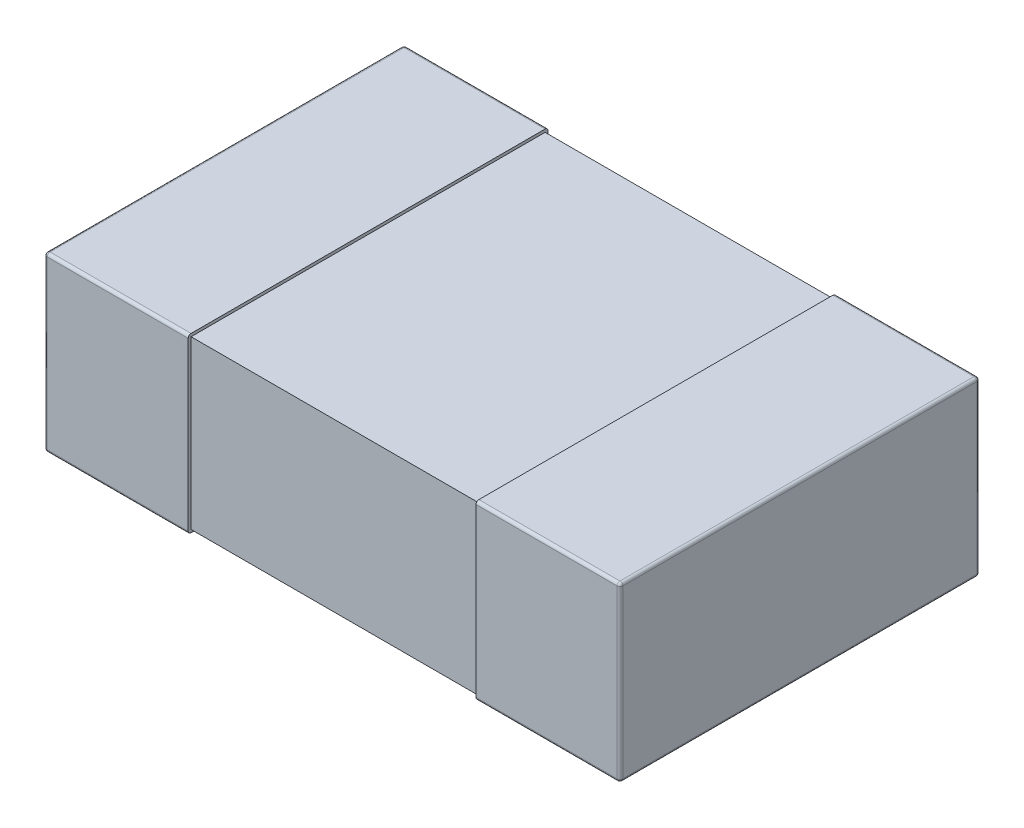
ISO-10303-21;
HEADER;
FILE_DESCRIPTION(('STEP AP214'),'2;1');
FILE_NAME('part.step','',(''),(''),'','','');
FILE_SCHEMA(('AUTOMOTIVE_DESIGN { 1 0 10303 214 1 1 1 1 }'));
ENDSEC;
DATA;
#1=APPLICATION_CONTEXT('core data for automotive mechanical design processes');
#2=APPLICATION_PROTOCOL_DEFINITION('international standard','automotive_design',2000,#1);
#3=PRODUCT_CONTEXT('',#1,'mechanical');
#4=PRODUCT('Part','Part','',(#3));
#5=PRODUCT_RELATED_PRODUCT_CATEGORY('part','',(#4));
#6=PRODUCT_DEFINITION_FORMATION('','',#4);
#7=PRODUCT_DEFINITION_CONTEXT('part definition',#1,'design');
#8=PRODUCT_DEFINITION('design','',#6,#7);
#9=PRODUCT_DEFINITION_SHAPE('','',#8);
#10=(LENGTH_UNIT() NAMED_UNIT(*) SI_UNIT(.MILLI.,.METRE.));
#11=(NAMED_UNIT(*) PLANE_ANGLE_UNIT() SI_UNIT($,.RADIAN.));
#12=(NAMED_UNIT(*) SI_UNIT($,.STERADIAN.) SOLID_ANGLE_UNIT());
#13=UNCERTAINTY_MEASURE_WITH_UNIT(LENGTH_MEASURE(1.E-05),#10,'distance_accuracy_value','');
#14=(GEOMETRIC_REPRESENTATION_CONTEXT(3) GLOBAL_UNCERTAINTY_ASSIGNED_CONTEXT((#13)) GLOBAL_UNIT_ASSIGNED_CONTEXT((#10,
#11,#12)) REPRESENTATION_CONTEXT('',''));
#15=CARTESIAN_POINT('',(0.,0.,0.));
#16=DIRECTION('',(0.,0.,1.));
#17=DIRECTION('',(1.,0.,0.));
#18=AXIS2_PLACEMENT_3D('',#15,#16,#17);
#19=CARTESIAN_POINT('',(-1.,0.3,-0.625));
#20=DIRECTION('',(1.,0.,0.));
#21=DIRECTION('',(0.,0.,-1.));
#22=AXIS2_PLACEMENT_3D('',#19,#20,#21);
#23=PLANE('',#22);
#24=DIRECTION('',(0.,0.,1.));
#25=VECTOR('',#24,1.);
#26=CARTESIAN_POINT('',(-1.,-0.29,-0.625));
#27=LINE('',#26,#25);
#28=CARTESIAN_POINT('',(-1.,-0.29,0.615));
#29=VERTEX_POINT('',#28);
#30=CARTESIAN_POINT('',(-1.,-0.29,-0.615));
#31=VERTEX_POINT('',#30);
#32=EDGE_CURVE('E414',#29,#31,#27,.F.);
#33=ORIENTED_EDGE('',*,*,#32,.F.);
#34=DIRECTION('',(0.,-1.,0.));
#35=VECTOR('',#34,1.);
#36=CARTESIAN_POINT('',(-1.,0.3,0.615));
#37=LINE('',#36,#35);
#38=CARTESIAN_POINT('',(-1.,0.29,0.615));
#39=VERTEX_POINT('',#38);
#40=EDGE_CURVE('E516',#39,#29,#37,.T.);
#41=ORIENTED_EDGE('',*,*,#40,.F.);
#42=DIRECTION('',(0.,0.,-1.));
#43=VECTOR('',#42,1.);
#44=CARTESIAN_POINT('',(-1.,0.29,0.625));
#45=LINE('',#44,#43);
#46=CARTESIAN_POINT('',(-1.,0.29,-0.615));
#47=VERTEX_POINT('',#46);
#48=EDGE_CURVE('E447',#47,#39,#45,.F.);
#49=ORIENTED_EDGE('',*,*,#48,.F.);
#50=DIRECTION('',(0.,-1.,0.));
#51=VECTOR('',#50,1.);
#52=CARTESIAN_POINT('',(-1.,0.3,-0.615));
#53=LINE('',#52,#51);
#54=EDGE_CURVE('E507',#31,#47,#53,.F.);
#55=ORIENTED_EDGE('',*,*,#54,.F.);
#56=EDGE_LOOP('',(#33,#41,#49,#55));
#57=FACE_BOUND('',#56,.T.);
#58=ADVANCED_FACE('F17',(#57),#23,.F.);
#59=CARTESIAN_POINT('',(1.,0.3,-0.625));
#60=DIRECTION('',(-1.,0.,0.));
#61=DIRECTION('',(0.,0.,1.));
#62=AXIS2_PLACEMENT_3D('',#59,#60,#61);
#63=PLANE('',#62);
#64=DIRECTION('',(0.,0.,-1.));
#65=VECTOR('',#64,1.);
#66=CARTESIAN_POINT('',(1.,0.29,0.625));
#67=LINE('',#66,#65);
#68=CARTESIAN_POINT('',(1.,0.29,0.615));
#69=VERTEX_POINT('',#68);
#70=CARTESIAN_POINT('',(1.,0.29,-0.615));
#71=VERTEX_POINT('',#70);
#72=EDGE_CURVE('E364',#69,#71,#67,.T.);
#73=ORIENTED_EDGE('',*,*,#72,.F.);
#74=DIRECTION('',(0.,-1.,0.));
#75=VECTOR('',#74,1.);
#76=CARTESIAN_POINT('',(1.,0.3,0.615));
#77=LINE('',#76,#75);
#78=CARTESIAN_POINT('',(1.,-0.29,0.615));
#79=VERTEX_POINT('',#78);
#80=EDGE_CURVE('E488',#79,#69,#77,.F.);
#81=ORIENTED_EDGE('',*,*,#80,.F.);
#82=DIRECTION('',(0.,0.,1.));
#83=VECTOR('',#82,1.);
#84=CARTESIAN_POINT('',(1.,-0.29,-0.625));
#85=LINE('',#84,#83);
#86=CARTESIAN_POINT('',(1.,-0.29,-0.615));
#87=VERTEX_POINT('',#86);
#88=EDGE_CURVE('E304',#87,#79,#85,.T.);
#89=ORIENTED_EDGE('',*,*,#88,.F.);
#90=DIRECTION('',(0.,-1.,0.));
#91=VECTOR('',#90,1.);
#92=CARTESIAN_POINT('',(1.,0.3,-0.615));
#93=LINE('',#92,#91);
#94=EDGE_CURVE('E497',#71,#87,#93,.T.);
#95=ORIENTED_EDGE('',*,*,#94,.F.);
#96=EDGE_LOOP('',(#73,#81,#89,#95));
#97=FACE_BOUND('',#96,.T.);
#98=ADVANCED_FACE('F477',(#97),#63,.F.);
#99=CARTESIAN_POINT('',(-0.99,-0.29,0.615));
#100=DIRECTION('',(1.,0.,0.));
#101=DIRECTION('',(0.,-1.,0.));
#102=AXIS2_PLACEMENT_3D('',#99,#100,#101);
#103=SPHERICAL_SURFACE('',#102,0.01);
#104=CARTESIAN_POINT('',(-0.99,-0.29,0.615));
#105=DIRECTION('',(0.,-1.,0.));
#106=DIRECTION('',(0.,0.,-1.));
#107=AXIS2_PLACEMENT_3D('',#104,#105,#106);
#108=CIRCLE('',#107,0.01);
#109=CARTESIAN_POINT('',(-0.99,-0.29,0.625));
#110=VERTEX_POINT('',#109);
#111=EDGE_CURVE('E519',#29,#110,#108,.F.);
#112=ORIENTED_EDGE('',*,*,#111,.F.);
#113=CARTESIAN_POINT('',(-0.99,-0.29,0.615));
#114=DIRECTION('',(0.,0.,1.));
#115=DIRECTION('',(1.,0.,0.));
#116=AXIS2_PLACEMENT_3D('',#113,#114,#115);
#117=CIRCLE('',#116,0.01);
#118=CARTESIAN_POINT('',(-0.99,-0.3,0.615));
#119=VERTEX_POINT('',#118);
#120=EDGE_CURVE('E401',#119,#29,#117,.F.);
#121=ORIENTED_EDGE('',*,*,#120,.F.);
#122=CARTESIAN_POINT('',(-0.99,-0.29,0.615));
#123=DIRECTION('',(1.,0.,0.));
#124=DIRECTION('',(0.,0.,-1.));
#125=AXIS2_PLACEMENT_3D('',#122,#123,#124);
#126=CIRCLE('',#125,0.01);
#127=EDGE_CURVE('E196',#110,#119,#126,.T.);
#128=ORIENTED_EDGE('',*,*,#127,.F.);
#129=EDGE_LOOP('',(#112,#121,#128));
#130=FACE_BOUND('',#129,.T.);
#131=ADVANCED_FACE('F473',(#130),#103,.T.);
#132=CARTESIAN_POINT('',(-0.99,0.3,0.615));
#133=DIRECTION('',(0.,-1.,0.));
#134=DIRECTION('',(0.,0.,-1.));
#135=AXIS2_PLACEMENT_3D('',#132,#133,#134);
#136=CYLINDRICAL_SURFACE('',#135,0.01);
#137=ORIENTED_EDGE('',*,*,#111,.T.);
#138=DIRECTION('',(0.,1.,0.));
#139=VECTOR('',#138,1.);
#140=CARTESIAN_POINT('',(-0.99,0.3,0.625));
#141=LINE('',#140,#139);
#142=CARTESIAN_POINT('',(-0.99,0.289999999999998,0.625));
#143=VERTEX_POINT('',#142);
#144=EDGE_CURVE('E195',#110,#143,#141,.T.);
#145=ORIENTED_EDGE('',*,*,#144,.T.);
#146=CARTESIAN_POINT('',(-0.99,0.29,0.615));
#147=DIRECTION('',(0.,-1.,-6.71279188273423E-13));
#148=DIRECTION('',(1.,0.,0.));
#149=AXIS2_PLACEMENT_3D('',#146,#147,#148);
#150=CIRCLE('',#149,0.01);
#151=EDGE_CURVE('E457',#39,#143,#150,.F.);
#152=ORIENTED_EDGE('',*,*,#151,.F.);
#153=ORIENTED_EDGE('',*,*,#40,.T.);
#154=EDGE_LOOP('',(#137,#145,#152,#153));
#155=FACE_BOUND('',#154,.T.);
#156=ADVANCED_FACE('F469',(#155),#136,.T.);
#157=CARTESIAN_POINT('',(-0.99,0.29,0.615));
#158=DIRECTION('',(1.,0.,0.));
#159=DIRECTION('',(0.,-1.,0.));
#160=AXIS2_PLACEMENT_3D('',#157,#158,#159);
#161=SPHERICAL_SURFACE('',#160,0.01);
#162=CARTESIAN_POINT('',(-0.99,0.29,0.615));
#163=DIRECTION('',(0.,0.,-1.));
#164=DIRECTION('',(-1.,0.,0.));
#165=AXIS2_PLACEMENT_3D('',#162,#163,#164);
#166=CIRCLE('',#165,0.01);
#167=CARTESIAN_POINT('',(-0.99,0.3,0.615));
#168=VERTEX_POINT('',#167);
#169=EDGE_CURVE('E454',#39,#168,#166,.T.);
#170=ORIENTED_EDGE('',*,*,#169,.F.);
#171=ORIENTED_EDGE('',*,*,#151,.T.);
#172=CARTESIAN_POINT('',(-0.99,0.29,0.615));
#173=DIRECTION('',(-1.,0.,0.));
#174=DIRECTION('',(0.,0.,1.));
#175=AXIS2_PLACEMENT_3D('',#172,#173,#174);
#176=CIRCLE('',#175,0.01);
#177=EDGE_CURVE('E292',#168,#143,#176,.F.);
#178=ORIENTED_EDGE('',*,*,#177,.F.);
#179=EDGE_LOOP('',(#170,#171,#178));
#180=FACE_BOUND('',#179,.T.);
#181=ADVANCED_FACE('F466',(#180),#161,.T.);
#182=CARTESIAN_POINT('',(-0.99,0.29,0.625));
#183=DIRECTION('',(0.,0.,-1.));
#184=DIRECTION('',(-1.,0.,0.));
#185=AXIS2_PLACEMENT_3D('',#182,#183,#184);
#186=CYLINDRICAL_SURFACE('',#185,0.01);
#187=CARTESIAN_POINT('',(-0.99,0.29,-0.615));
#188=DIRECTION('',(0.,0.,1.));
#189=DIRECTION('',(1.,0.,0.));
#190=AXIS2_PLACEMENT_3D('',#187,#188,#189);
#191=CIRCLE('',#190,0.01);
#192=CARTESIAN_POINT('',(-0.99,0.3,-0.615));
#193=VERTEX_POINT('',#192);
#194=EDGE_CURVE('E443',#47,#193,#191,.F.);
#195=ORIENTED_EDGE('',*,*,#194,.F.);
#196=ORIENTED_EDGE('',*,*,#48,.T.);
#197=ORIENTED_EDGE('',*,*,#169,.T.);
#198=DIRECTION('',(0.,0.,1.));
#199=VECTOR('',#198,1.);
#200=CARTESIAN_POINT('',(-0.99,0.3,0.625));
#201=LINE('',#200,#199);
#202=EDGE_CURVE('E287',#193,#168,#201,.T.);
#203=ORIENTED_EDGE('',*,*,#202,.F.);
#204=EDGE_LOOP('',(#195,#196,#197,#203));
#205=FACE_BOUND('',#204,.T.);
#206=ADVANCED_FACE('F435',(#205),#186,.T.);
#207=CARTESIAN_POINT('',(-0.99,0.29,-0.615));
#208=DIRECTION('',(1.,0.,0.));
#209=DIRECTION('',(0.,-1.,0.));
#210=AXIS2_PLACEMENT_3D('',#207,#208,#209);
#211=SPHERICAL_SURFACE('',#210,0.01);
#212=CARTESIAN_POINT('',(-0.99,0.29,-0.615));
#213=DIRECTION('',(1.,0.,0.));
#214=DIRECTION('',(0.,0.,-1.));
#215=AXIS2_PLACEMENT_3D('',#212,#213,#214);
#216=CIRCLE('',#215,0.01);
#217=CARTESIAN_POINT('',(-0.99,0.29,-0.625));
#218=VERTEX_POINT('',#217);
#219=EDGE_CURVE('E281',#218,#193,#216,.T.);
#220=ORIENTED_EDGE('',*,*,#219,.F.);
#221=CARTESIAN_POINT('',(-0.99,0.29,-0.615));
#222=DIRECTION('',(0.,-1.,0.));
#223=DIRECTION('',(0.,0.,-1.));
#224=AXIS2_PLACEMENT_3D('',#221,#222,#223);
#225=CIRCLE('',#224,0.01);
#226=EDGE_CURVE('E446',#47,#218,#225,.T.);
#227=ORIENTED_EDGE('',*,*,#226,.F.);
#228=ORIENTED_EDGE('',*,*,#194,.T.);
#229=EDGE_LOOP('',(#220,#227,#228));
#230=FACE_BOUND('',#229,.T.);
#231=ADVANCED_FACE('F430',(#230),#211,.T.);
#232=CARTESIAN_POINT('',(-0.99,0.3,-0.615));
#233=DIRECTION('',(0.,-1.,0.));
#234=DIRECTION('',(0.,0.,-1.));
#235=AXIS2_PLACEMENT_3D('',#232,#233,#234);
#236=CYLINDRICAL_SURFACE('',#235,0.01);
#237=CARTESIAN_POINT('',(-0.99,-0.29,-0.615));
#238=DIRECTION('',(0.,1.,0.));
#239=DIRECTION('',(1.,0.,0.));
#240=AXIS2_PLACEMENT_3D('',#237,#238,#239);
#241=CIRCLE('',#240,0.01);
#242=CARTESIAN_POINT('',(-0.99,-0.29,-0.625));
#243=VERTEX_POINT('',#242);
#244=EDGE_CURVE('E402',#31,#243,#241,.F.);
#245=ORIENTED_EDGE('',*,*,#244,.F.);
#246=ORIENTED_EDGE('',*,*,#54,.T.);
#247=ORIENTED_EDGE('',*,*,#226,.T.);
#248=DIRECTION('',(0.,1.,0.));
#249=VECTOR('',#248,1.);
#250=CARTESIAN_POINT('',(-0.99,0.3,-0.625));
#251=LINE('',#250,#249);
#252=EDGE_CURVE('E275',#218,#243,#251,.F.);
#253=ORIENTED_EDGE('',*,*,#252,.T.);
#254=EDGE_LOOP('',(#245,#246,#247,#253));
#255=FACE_BOUND('',#254,.T.);
#256=ADVANCED_FACE('F426',(#255),#236,.T.);
#257=CARTESIAN_POINT('',(-0.99,-0.29,-0.615));
#258=DIRECTION('',(1.,0.,0.));
#259=DIRECTION('',(0.,-1.,0.));
#260=AXIS2_PLACEMENT_3D('',#257,#258,#259);
#261=SPHERICAL_SURFACE('',#260,0.01);
#262=CARTESIAN_POINT('',(-0.99,-0.29,-0.615));
#263=DIRECTION('',(-1.,0.,0.));
#264=DIRECTION('',(0.,0.,1.));
#265=AXIS2_PLACEMENT_3D('',#262,#263,#264);
#266=CIRCLE('',#265,0.01);
#267=CARTESIAN_POINT('',(-0.99,-0.3,-0.615));
#268=VERTEX_POINT('',#267);
#269=EDGE_CURVE('E269',#268,#243,#266,.F.);
#270=ORIENTED_EDGE('',*,*,#269,.F.);
#271=CARTESIAN_POINT('',(-0.99,-0.29,-0.615));
#272=DIRECTION('',(0.,0.,1.));
#273=DIRECTION('',(1.,0.,0.));
#274=AXIS2_PLACEMENT_3D('',#271,#272,#273);
#275=CIRCLE('',#274,0.01);
#276=EDGE_CURVE('E398',#31,#268,#275,.T.);
#277=ORIENTED_EDGE('',*,*,#276,.F.);
#278=ORIENTED_EDGE('',*,*,#244,.T.);
#279=EDGE_LOOP('',(#270,#277,#278));
#280=FACE_BOUND('',#279,.T.);
#281=ADVANCED_FACE('F423',(#280),#261,.T.);
#282=CARTESIAN_POINT('',(-0.99,-0.29,-0.625));
#283=DIRECTION('',(0.,0.,1.));
#284=DIRECTION('',(1.,0.,0.));
#285=AXIS2_PLACEMENT_3D('',#282,#283,#284);
#286=CYLINDRICAL_SURFACE('',#285,0.01);
#287=ORIENTED_EDGE('',*,*,#120,.T.);
#288=ORIENTED_EDGE('',*,*,#32,.T.);
#289=ORIENTED_EDGE('',*,*,#276,.T.);
#290=DIRECTION('',(0.,0.,1.));
#291=VECTOR('',#290,1.);
#292=CARTESIAN_POINT('',(-0.99,-0.3,0.625));
#293=LINE('',#292,#291);
#294=EDGE_CURVE('E260',#268,#119,#293,.T.);
#295=ORIENTED_EDGE('',*,*,#294,.T.);
#296=EDGE_LOOP('',(#287,#288,#289,#295));
#297=FACE_BOUND('',#296,.T.);
#298=ADVANCED_FACE('F386',(#297),#286,.T.);
#299=CARTESIAN_POINT('',(0.99,-0.29,-0.615));
#300=DIRECTION('',(-1.,0.,0.));
#301=DIRECTION('',(0.,1.,0.));
#302=AXIS2_PLACEMENT_3D('',#299,#300,#301);
#303=SPHERICAL_SURFACE('',#302,0.01);
#304=CARTESIAN_POINT('',(0.99,-0.29,-0.615));
#305=DIRECTION('',(0.,0.,1.));
#306=DIRECTION('',(1.,0.,0.));
#307=AXIS2_PLACEMENT_3D('',#304,#305,#306);
#308=CIRCLE('',#307,0.01);
#309=CARTESIAN_POINT('',(0.99,-0.3,-0.615));
#310=VERTEX_POINT('',#309);
#311=EDGE_CURVE('E315',#310,#87,#308,.T.);
#312=ORIENTED_EDGE('',*,*,#311,.F.);
#313=CARTESIAN_POINT('',(0.99,-0.29,-0.615));
#314=DIRECTION('',(1.,0.,0.));
#315=DIRECTION('',(0.,0.,-1.));
#316=AXIS2_PLACEMENT_3D('',#313,#314,#315);
#317=CIRCLE('',#316,0.01);
#318=CARTESIAN_POINT('',(0.99,-0.29,-0.625));
#319=VERTEX_POINT('',#318);
#320=EDGE_CURVE('E254',#319,#310,#317,.F.);
#321=ORIENTED_EDGE('',*,*,#320,.F.);
#322=CARTESIAN_POINT('',(0.99,-0.29,-0.615));
#323=DIRECTION('',(0.,-1.,0.));
#324=DIRECTION('',(0.,0.,-1.));
#325=AXIS2_PLACEMENT_3D('',#322,#323,#324);
#326=CIRCLE('',#325,0.01);
#327=EDGE_CURVE('E500',#87,#319,#326,.F.);
#328=ORIENTED_EDGE('',*,*,#327,.F.);
#329=EDGE_LOOP('',(#312,#321,#328));
#330=FACE_BOUND('',#329,.T.);
#331=ADVANCED_FACE('F381',(#330),#303,.T.);
#332=CARTESIAN_POINT('',(0.99,0.3,-0.615));
#333=DIRECTION('',(0.,-1.,0.));
#334=DIRECTION('',(0.,0.,-1.));
#335=AXIS2_PLACEMENT_3D('',#332,#333,#334);
#336=CYLINDRICAL_SURFACE('',#335,0.01);
#337=ORIENTED_EDGE('',*,*,#327,.T.);
#338=DIRECTION('',(0.,1.,0.));
#339=VECTOR('',#338,1.);
#340=CARTESIAN_POINT('',(0.99,0.3,-0.625));
#341=LINE('',#340,#339);
#342=CARTESIAN_POINT('',(0.99,0.289999999999998,-0.625));
#343=VERTEX_POINT('',#342);
#344=EDGE_CURVE('E253',#319,#343,#341,.T.);
#345=ORIENTED_EDGE('',*,*,#344,.T.);
#346=CARTESIAN_POINT('',(0.99,0.29,-0.615));
#347=DIRECTION('',(0.,-1.,6.71401652953337E-13));
#348=DIRECTION('',(-1.,0.,0.));
#349=AXIS2_PLACEMENT_3D('',#346,#347,#348);
#350=CIRCLE('',#349,0.01);
#351=EDGE_CURVE('E372',#71,#343,#350,.F.);
#352=ORIENTED_EDGE('',*,*,#351,.F.);
#353=ORIENTED_EDGE('',*,*,#94,.T.);
#354=EDGE_LOOP('',(#337,#345,#352,#353));
#355=FACE_BOUND('',#354,.T.);
#356=ADVANCED_FACE('F377',(#355),#336,.T.);
#357=CARTESIAN_POINT('',(0.99,0.29,-0.615));
#358=DIRECTION('',(-1.,0.,0.));
#359=DIRECTION('',(0.,1.,0.));
#360=AXIS2_PLACEMENT_3D('',#357,#358,#359);
#361=SPHERICAL_SURFACE('',#360,0.01);
#362=ORIENTED_EDGE('',*,*,#351,.T.);
#363=CARTESIAN_POINT('',(0.99,0.29,-0.615));
#364=DIRECTION('',(-1.,0.,0.));
#365=DIRECTION('',(0.,0.,1.));
#366=AXIS2_PLACEMENT_3D('',#363,#364,#365);
#367=CIRCLE('',#366,0.01);
#368=CARTESIAN_POINT('',(0.99,0.3,-0.615));
#369=VERTEX_POINT('',#368);
#370=EDGE_CURVE('E247',#369,#343,#367,.T.);
#371=ORIENTED_EDGE('',*,*,#370,.F.);
#372=CARTESIAN_POINT('',(0.99,0.29,-0.615));
#373=DIRECTION('',(0.,0.,-1.));
#374=DIRECTION('',(-1.,0.,0.));
#375=AXIS2_PLACEMENT_3D('',#372,#373,#374);
#376=CIRCLE('',#375,0.01);
#377=EDGE_CURVE('E355',#71,#369,#376,.F.);
#378=ORIENTED_EDGE('',*,*,#377,.F.);
#379=EDGE_LOOP('',(#362,#371,#378));
#380=FACE_BOUND('',#379,.T.);
#381=ADVANCED_FACE('F374',(#380),#361,.T.);
#382=CARTESIAN_POINT('',(0.99,0.29,0.625));
#383=DIRECTION('',(0.,0.,-1.));
#384=DIRECTION('',(-1.,0.,0.));
#385=AXIS2_PLACEMENT_3D('',#382,#383,#384);
#386=CYLINDRICAL_SURFACE('',#385,0.01);
#387=ORIENTED_EDGE('',*,*,#377,.T.);
#388=DIRECTION('',(0.,0.,1.));
#389=VECTOR('',#388,1.);
#390=CARTESIAN_POINT('',(0.99,0.3,0.625));
#391=LINE('',#390,#389);
#392=CARTESIAN_POINT('',(0.99,0.3,0.615));
#393=VERTEX_POINT('',#392);
#394=EDGE_CURVE('E241',#393,#369,#391,.F.);
#395=ORIENTED_EDGE('',*,*,#394,.F.);
#396=CARTESIAN_POINT('',(0.99,0.29,0.615));
#397=DIRECTION('',(0.,0.,-1.));
#398=DIRECTION('',(-1.,0.,0.));
#399=AXIS2_PLACEMENT_3D('',#396,#397,#398);
#400=CIRCLE('',#399,0.01);
#401=EDGE_CURVE('E351',#69,#393,#400,.F.);
#402=ORIENTED_EDGE('',*,*,#401,.F.);
#403=ORIENTED_EDGE('',*,*,#72,.T.);
#404=EDGE_LOOP('',(#387,#395,#402,#403));
#405=FACE_BOUND('',#404,.T.);
#406=ADVANCED_FACE('F343',(#405),#386,.T.);
#407=CARTESIAN_POINT('',(0.99,0.29,0.615));
#408=DIRECTION('',(-1.,0.,0.));
#409=DIRECTION('',(0.,1.,0.));
#410=AXIS2_PLACEMENT_3D('',#407,#408,#409);
#411=SPHERICAL_SURFACE('',#410,0.01);
#412=CARTESIAN_POINT('',(0.99,0.29,0.615));
#413=DIRECTION('',(0.,-1.,0.));
#414=DIRECTION('',(0.,0.,-1.));
#415=AXIS2_PLACEMENT_3D('',#412,#413,#414);
#416=CIRCLE('',#415,0.01);
#417=CARTESIAN_POINT('',(0.99,0.29,0.625));
#418=VERTEX_POINT('',#417);
#419=EDGE_CURVE('E354',#69,#418,#416,.T.);
#420=ORIENTED_EDGE('',*,*,#419,.F.);
#421=ORIENTED_EDGE('',*,*,#401,.T.);
#422=CARTESIAN_POINT('',(0.99,0.29,0.615));
#423=DIRECTION('',(1.,0.,0.));
#424=DIRECTION('',(0.,0.,-1.));
#425=AXIS2_PLACEMENT_3D('',#422,#423,#424);
#426=CIRCLE('',#425,0.01);
#427=EDGE_CURVE('E235',#418,#393,#426,.F.);
#428=ORIENTED_EDGE('',*,*,#427,.F.);
#429=EDGE_LOOP('',(#420,#421,#428));
#430=FACE_BOUND('',#429,.T.);
#431=ADVANCED_FACE('F338',(#430),#411,.T.);
#432=CARTESIAN_POINT('',(0.99,0.3,0.615));
#433=DIRECTION('',(0.,-1.,0.));
#434=DIRECTION('',(0.,0.,-1.));
#435=AXIS2_PLACEMENT_3D('',#432,#433,#434);
#436=CYLINDRICAL_SURFACE('',#435,0.01);
#437=CARTESIAN_POINT('',(0.99,-0.29,0.615));
#438=DIRECTION('',(0.,1.,0.));
#439=DIRECTION('',(-1.,0.,0.));
#440=AXIS2_PLACEMENT_3D('',#437,#438,#439);
#441=CIRCLE('',#440,0.01);
#442=CARTESIAN_POINT('',(0.99,-0.29,0.625));
#443=VERTEX_POINT('',#442);
#444=EDGE_CURVE('E318',#79,#443,#441,.F.);
#445=ORIENTED_EDGE('',*,*,#444,.F.);
#446=ORIENTED_EDGE('',*,*,#80,.T.);
#447=ORIENTED_EDGE('',*,*,#419,.T.);
#448=DIRECTION('',(0.,1.,0.));
#449=VECTOR('',#448,1.);
#450=CARTESIAN_POINT('',(0.99,0.3,0.625));
#451=LINE('',#450,#449);
#452=EDGE_CURVE('E229',#418,#443,#451,.F.);
#453=ORIENTED_EDGE('',*,*,#452,.T.);
#454=EDGE_LOOP('',(#445,#446,#447,#453));
#455=FACE_BOUND('',#454,.T.);
#456=ADVANCED_FACE('F333',(#455),#436,.T.);
#457=CARTESIAN_POINT('',(0.99,-0.29,0.615));
#458=DIRECTION('',(-1.,0.,0.));
#459=DIRECTION('',(0.,1.,0.));
#460=AXIS2_PLACEMENT_3D('',#457,#458,#459);
#461=SPHERICAL_SURFACE('',#460,0.01);
#462=CARTESIAN_POINT('',(0.99,-0.29,0.615));
#463=DIRECTION('',(0.,0.,1.));
#464=DIRECTION('',(1.,0.,0.));
#465=AXIS2_PLACEMENT_3D('',#462,#463,#464);
#466=CIRCLE('',#465,0.01);
#467=CARTESIAN_POINT('',(0.99,-0.3,0.615));
#468=VERTEX_POINT('',#467);
#469=EDGE_CURVE('E301',#79,#468,#466,.F.);
#470=ORIENTED_EDGE('',*,*,#469,.F.);
#471=ORIENTED_EDGE('',*,*,#444,.T.);
#472=CARTESIAN_POINT('',(0.99,-0.29,0.615));
#473=DIRECTION('',(-1.,0.,0.));
#474=DIRECTION('',(0.,0.,1.));
#475=AXIS2_PLACEMENT_3D('',#472,#473,#474);
#476=CIRCLE('',#475,0.01);
#477=EDGE_CURVE('E223',#468,#443,#476,.T.);
#478=ORIENTED_EDGE('',*,*,#477,.F.);
#479=EDGE_LOOP('',(#470,#471,#478));
#480=FACE_BOUND('',#479,.T.);
#481=ADVANCED_FACE('F328',(#480),#461,.T.);
#482=CARTESIAN_POINT('',(0.99,-0.29,-0.625));
#483=DIRECTION('',(0.,0.,1.));
#484=DIRECTION('',(1.,0.,0.));
#485=AXIS2_PLACEMENT_3D('',#482,#483,#484);
#486=CYLINDRICAL_SURFACE('',#485,0.01);
#487=ORIENTED_EDGE('',*,*,#469,.T.);
#488=DIRECTION('',(0.,0.,1.));
#489=VECTOR('',#488,1.);
#490=CARTESIAN_POINT('',(0.99,-0.3,0.625));
#491=LINE('',#490,#489);
#492=EDGE_CURVE('E210',#468,#310,#491,.F.);
#493=ORIENTED_EDGE('',*,*,#492,.T.);
#494=ORIENTED_EDGE('',*,*,#311,.T.);
#495=ORIENTED_EDGE('',*,*,#88,.T.);
#496=EDGE_LOOP('',(#487,#493,#494,#495));
#497=FACE_BOUND('',#496,.T.);
#498=ADVANCED_FACE('F332',(#497),#486,.T.);
#499=CARTESIAN_POINT('',(-1.,-0.29,0.615));
#500=DIRECTION('',(1.,0.,0.));
#501=DIRECTION('',(0.,0.,-1.));
#502=AXIS2_PLACEMENT_3D('',#499,#500,#501);
#503=CYLINDRICAL_SURFACE('',#502,0.01);
#504=ORIENTED_EDGE('',*,*,#127,.T.);
#505=DIRECTION('',(1.,0.,0.));
#506=VECTOR('',#505,1.);
#507=CARTESIAN_POINT('',(-1.,-0.3,0.615));
#508=LINE('',#507,#506);
#509=CARTESIAN_POINT('',(-0.5,-0.3,0.615));
#510=VERTEX_POINT('',#509);
#511=EDGE_CURVE('E177',#119,#510,#508,.T.);
#512=ORIENTED_EDGE('',*,*,#511,.T.);
#513=CARTESIAN_POINT('',(-0.5,-0.29,0.615));
#514=DIRECTION('',(1.,0.,0.));
#515=DIRECTION('',(0.,0.,-1.));
#516=AXIS2_PLACEMENT_3D('',#513,#514,#515);
#517=CIRCLE('',#516,0.01);
#518=CARTESIAN_POINT('',(-0.5,-0.29,0.625));
#519=VERTEX_POINT('',#518);
#520=EDGE_CURVE('E20',#510,#519,#517,.F.);
#521=ORIENTED_EDGE('',*,*,#520,.T.);
#522=DIRECTION('',(-1.,0.,0.));
#523=VECTOR('',#522,1.);
#524=CARTESIAN_POINT('',(-1.,-0.29,0.625));
#525=LINE('',#524,#523);
#526=EDGE_CURVE('E183',#519,#110,#525,.T.);
#527=ORIENTED_EDGE('',*,*,#526,.T.);
#528=EDGE_LOOP('',(#504,#512,#521,#527));
#529=FACE_BOUND('',#528,.T.);
#530=ADVANCED_FACE('F182',(#529),#503,.T.);
#531=CARTESIAN_POINT('',(-1.,0.3,0.625));
#532=DIRECTION('',(0.,0.,-1.));
#533=DIRECTION('',(-1.,0.,0.));
#534=AXIS2_PLACEMENT_3D('',#531,#532,#533);
#535=PLANE('',#534);
#536=ORIENTED_EDGE('',*,*,#526,.F.);
#537=DIRECTION('',(0.,1.,0.));
#538=VECTOR('',#537,1.);
#539=CARTESIAN_POINT('',(-0.5,0.3,0.625));
#540=LINE('',#539,#538);
#541=CARTESIAN_POINT('',(-0.5,0.29,0.625));
#542=VERTEX_POINT('',#541);
#543=EDGE_CURVE('E188',#519,#542,#540,.T.);
#544=ORIENTED_EDGE('',*,*,#543,.T.);
#545=DIRECTION('',(-1.,0.,0.));
#546=VECTOR('',#545,1.);
#547=CARTESIAN_POINT('',(-1.,0.29,0.625));
#548=LINE('',#547,#546);
#549=EDGE_CURVE('E290',#143,#542,#548,.F.);
#550=ORIENTED_EDGE('',*,*,#549,.F.);
#551=ORIENTED_EDGE('',*,*,#144,.F.);
#552=EDGE_LOOP('',(#536,#544,#550,#551));
#553=FACE_BOUND('',#552,.T.);
#554=ADVANCED_FACE('F192',(#553),#535,.F.);
#555=CARTESIAN_POINT('',(-1.,0.29,0.615));
#556=DIRECTION('',(-1.,0.,0.));
#557=DIRECTION('',(0.,0.,1.));
#558=AXIS2_PLACEMENT_3D('',#555,#556,#557);
#559=CYLINDRICAL_SURFACE('',#558,0.01);
#560=ORIENTED_EDGE('',*,*,#177,.T.);
#561=ORIENTED_EDGE('',*,*,#549,.T.);
#562=CARTESIAN_POINT('',(-0.5,0.29,0.615));
#563=DIRECTION('',(-1.,0.,0.));
#564=DIRECTION('',(0.,0.,1.));
#565=AXIS2_PLACEMENT_3D('',#562,#563,#564);
#566=CIRCLE('',#565,0.01);
#567=CARTESIAN_POINT('',(-0.5,0.3,0.615));
#568=VERTEX_POINT('',#567);
#569=EDGE_CURVE('E202',#542,#568,#566,.T.);
#570=ORIENTED_EDGE('',*,*,#569,.T.);
#571=DIRECTION('',(1.,0.,0.));
#572=VECTOR('',#571,1.);
#573=CARTESIAN_POINT('',(-1.,0.3,0.615));
#574=LINE('',#573,#572);
#575=EDGE_CURVE('E284',#168,#568,#574,.T.);
#576=ORIENTED_EDGE('',*,*,#575,.F.);
#577=EDGE_LOOP('',(#560,#561,#570,#576));
#578=FACE_BOUND('',#577,.T.);
#579=ADVANCED_FACE('F575',(#578),#559,.T.);
#580=CARTESIAN_POINT('',(-1.,0.3,0.625));
#581=DIRECTION('',(0.,1.,0.));
#582=DIRECTION('',(0.,0.,1.));
#583=AXIS2_PLACEMENT_3D('',#580,#581,#582);
#584=PLANE('',#583);
#585=ORIENTED_EDGE('',*,*,#202,.T.);
#586=ORIENTED_EDGE('',*,*,#575,.T.);
#587=DIRECTION('',(0.,0.,1.));
#588=VECTOR('',#587,1.);
#589=CARTESIAN_POINT('',(-0.5,0.3,-0.625));
#590=LINE('',#589,#588);
#591=CARTESIAN_POINT('',(-0.5,0.3,-0.615));
#592=VERTEX_POINT('',#591);
#593=EDGE_CURVE('E204',#568,#592,#590,.F.);
#594=ORIENTED_EDGE('',*,*,#593,.T.);
#595=DIRECTION('',(1.,0.,0.));
#596=VECTOR('',#595,1.);
#597=CARTESIAN_POINT('',(-1.,0.3,-0.615));
#598=LINE('',#597,#596);
#599=EDGE_CURVE('E276',#193,#592,#598,.T.);
#600=ORIENTED_EDGE('',*,*,#599,.F.);
#601=EDGE_LOOP('',(#585,#586,#594,#600));
#602=FACE_BOUND('',#601,.T.);
#603=ADVANCED_FACE('F546',(#602),#584,.T.);
#604=CARTESIAN_POINT('',(-1.,0.29,-0.615));
#605=DIRECTION('',(1.,0.,0.));
#606=DIRECTION('',(0.,0.,-1.));
#607=AXIS2_PLACEMENT_3D('',#604,#605,#606);
#608=CYLINDRICAL_SURFACE('',#607,0.01);
#609=ORIENTED_EDGE('',*,*,#219,.T.);
#610=ORIENTED_EDGE('',*,*,#599,.T.);
#611=CARTESIAN_POINT('',(-0.5,0.29,-0.615));
#612=DIRECTION('',(1.,0.,0.));
#613=DIRECTION('',(0.,0.,-1.));
#614=AXIS2_PLACEMENT_3D('',#611,#612,#613);
#615=CIRCLE('',#614,0.01);
#616=CARTESIAN_POINT('',(-0.5,0.29,-0.625));
#617=VERTEX_POINT('',#616);
#618=EDGE_CURVE('E539',#592,#617,#615,.F.);
#619=ORIENTED_EDGE('',*,*,#618,.T.);
#620=DIRECTION('',(1.,0.,0.));
#621=VECTOR('',#620,1.);
#622=CARTESIAN_POINT('',(-1.,0.29,-0.625));
#623=LINE('',#622,#621);
#624=EDGE_CURVE('E272',#617,#218,#623,.F.);
#625=ORIENTED_EDGE('',*,*,#624,.T.);
#626=EDGE_LOOP('',(#609,#610,#619,#625));
#627=FACE_BOUND('',#626,.T.);
#628=ADVANCED_FACE('F549',(#627),#608,.T.);
#629=CARTESIAN_POINT('',(-1.,0.3,-0.625));
#630=DIRECTION('',(0.,0.,1.));
#631=DIRECTION('',(1.,0.,0.));
#632=AXIS2_PLACEMENT_3D('',#629,#630,#631);
#633=PLANE('',#632);
#634=DIRECTION('',(-1.,0.,0.));
#635=VECTOR('',#634,1.);
#636=CARTESIAN_POINT('',(-1.,-0.29,-0.625));
#637=LINE('',#636,#635);
#638=CARTESIAN_POINT('',(-0.5,-0.29,-0.625));
#639=VERTEX_POINT('',#638);
#640=EDGE_CURVE('E264',#243,#639,#637,.F.);
#641=ORIENTED_EDGE('',*,*,#640,.F.);
#642=ORIENTED_EDGE('',*,*,#252,.F.);
#643=ORIENTED_EDGE('',*,*,#624,.F.);
#644=DIRECTION('',(0.,1.,0.));
#645=VECTOR('',#644,1.);
#646=CARTESIAN_POINT('',(-0.5,0.3,-0.625));
#647=LINE('',#646,#645);
#648=EDGE_CURVE('E538',#617,#639,#647,.F.);
#649=ORIENTED_EDGE('',*,*,#648,.T.);
#650=EDGE_LOOP('',(#641,#642,#643,#649));
#651=FACE_BOUND('',#650,.T.);
#652=ADVANCED_FACE('F553',(#651),#633,.F.);
#653=CARTESIAN_POINT('',(-1.,-0.29,-0.615));
#654=DIRECTION('',(-1.,0.,0.));
#655=DIRECTION('',(0.,0.,1.));
#656=AXIS2_PLACEMENT_3D('',#653,#654,#655);
#657=CYLINDRICAL_SURFACE('',#656,0.01);
#658=ORIENTED_EDGE('',*,*,#269,.T.);
#659=ORIENTED_EDGE('',*,*,#640,.T.);
#660=CARTESIAN_POINT('',(-0.5,-0.29,-0.615));
#661=DIRECTION('',(-1.,0.,0.));
#662=DIRECTION('',(0.,0.,1.));
#663=AXIS2_PLACEMENT_3D('',#660,#661,#662);
#664=CIRCLE('',#663,0.01);
#665=CARTESIAN_POINT('',(-0.5,-0.3,-0.615));
#666=VERTEX_POINT('',#665);
#667=EDGE_CURVE('E535',#639,#666,#664,.T.);
#668=ORIENTED_EDGE('',*,*,#667,.T.);
#669=DIRECTION('',(1.,0.,0.));
#670=VECTOR('',#669,1.);
#671=CARTESIAN_POINT('',(-1.,-0.3,-0.615));
#672=LINE('',#671,#670);
#673=EDGE_CURVE('E257',#666,#268,#672,.F.);
#674=ORIENTED_EDGE('',*,*,#673,.T.);
#675=EDGE_LOOP('',(#658,#659,#668,#674));
#676=FACE_BOUND('',#675,.T.);
#677=ADVANCED_FACE('F556',(#676),#657,.T.);
#678=CARTESIAN_POINT('',(-1.,-0.3,0.625));
#679=DIRECTION('',(0.,1.,0.));
#680=DIRECTION('',(0.,0.,1.));
#681=AXIS2_PLACEMENT_3D('',#678,#679,#680);
#682=PLANE('',#681);
#683=ORIENTED_EDGE('',*,*,#673,.F.);
#684=DIRECTION('',(0.,0.,1.));
#685=VECTOR('',#684,1.);
#686=CARTESIAN_POINT('',(-0.5,-0.3,-0.625));
#687=LINE('',#686,#685);
#688=EDGE_CURVE('E537',#666,#510,#687,.T.);
#689=ORIENTED_EDGE('',*,*,#688,.T.);
#690=ORIENTED_EDGE('',*,*,#511,.F.);
#691=ORIENTED_EDGE('',*,*,#294,.F.);
#692=EDGE_LOOP('',(#683,#689,#690,#691));
#693=FACE_BOUND('',#692,.T.);
#694=ADVANCED_FACE('F645',(#693),#682,.F.);
#695=CARTESIAN_POINT('',(1.,-0.29,-0.615));
#696=DIRECTION('',(1.,0.,0.));
#697=DIRECTION('',(0.,0.,-1.));
#698=AXIS2_PLACEMENT_3D('',#695,#696,#697);
#699=CYLINDRICAL_SURFACE('',#698,0.01);
#700=ORIENTED_EDGE('',*,*,#320,.T.);
#701=DIRECTION('',(1.,0.,0.));
#702=VECTOR('',#701,1.);
#703=CARTESIAN_POINT('',(1.,-0.3,-0.615));
#704=LINE('',#703,#702);
#705=CARTESIAN_POINT('',(0.5,-0.3,-0.615));
#706=VERTEX_POINT('',#705);
#707=EDGE_CURVE('E214',#310,#706,#704,.F.);
#708=ORIENTED_EDGE('',*,*,#707,.T.);
#709=CARTESIAN_POINT('',(0.5,-0.29,-0.615));
#710=DIRECTION('',(1.,0.,0.));
#711=DIRECTION('',(0.,0.,-1.));
#712=AXIS2_PLACEMENT_3D('',#709,#710,#711);
#713=CIRCLE('',#712,0.01);
#714=CARTESIAN_POINT('',(0.5,-0.29,-0.625));
#715=VERTEX_POINT('',#714);
#716=EDGE_CURVE('E532',#706,#715,#713,.T.);
#717=ORIENTED_EDGE('',*,*,#716,.T.);
#718=DIRECTION('',(1.,0.,0.));
#719=VECTOR('',#718,1.);
#720=CARTESIAN_POINT('',(1.,-0.29,-0.625));
#721=LINE('',#720,#719);
#722=EDGE_CURVE('E250',#715,#319,#721,.T.);
#723=ORIENTED_EDGE('',*,*,#722,.T.);
#724=EDGE_LOOP('',(#700,#708,#717,#723));
#725=FACE_BOUND('',#724,.T.);
#726=ADVANCED_FACE('F641',(#725),#699,.T.);
#727=CARTESIAN_POINT('',(1.,0.3,-0.625));
#728=DIRECTION('',(0.,0.,1.));
#729=DIRECTION('',(1.,0.,0.));
#730=AXIS2_PLACEMENT_3D('',#727,#728,#729);
#731=PLANE('',#730);
#732=DIRECTION('',(-1.,0.,0.));
#733=VECTOR('',#732,1.);
#734=CARTESIAN_POINT('',(1.,0.29,-0.625));
#735=LINE('',#734,#733);
#736=CARTESIAN_POINT('',(0.5,0.29,-0.625));
#737=VERTEX_POINT('',#736);
#738=EDGE_CURVE('E244',#343,#737,#735,.T.);
#739=ORIENTED_EDGE('',*,*,#738,.F.);
#740=ORIENTED_EDGE('',*,*,#344,.F.);
#741=ORIENTED_EDGE('',*,*,#722,.F.);
#742=DIRECTION('',(0.,1.,0.));
#743=VECTOR('',#742,1.);
#744=CARTESIAN_POINT('',(0.5,0.3,-0.625));
#745=LINE('',#744,#743);
#746=EDGE_CURVE('E531',#715,#737,#745,.T.);
#747=ORIENTED_EDGE('',*,*,#746,.T.);
#748=EDGE_LOOP('',(#739,#740,#741,#747));
#749=FACE_BOUND('',#748,.T.);
#750=ADVANCED_FACE('F637',(#749),#731,.F.);
#751=CARTESIAN_POINT('',(1.,0.29,-0.615));
#752=DIRECTION('',(-1.,0.,0.));
#753=DIRECTION('',(0.,0.,1.));
#754=AXIS2_PLACEMENT_3D('',#751,#752,#753);
#755=CYLINDRICAL_SURFACE('',#754,0.01);
#756=ORIENTED_EDGE('',*,*,#370,.T.);
#757=ORIENTED_EDGE('',*,*,#738,.T.);
#758=CARTESIAN_POINT('',(0.5,0.29,-0.615));
#759=DIRECTION('',(-1.,0.,0.));
#760=DIRECTION('',(0.,0.,1.));
#761=AXIS2_PLACEMENT_3D('',#758,#759,#760);
#762=CIRCLE('',#761,0.01);
#763=CARTESIAN_POINT('',(0.5,0.3,-0.615));
#764=VERTEX_POINT('',#763);
#765=EDGE_CURVE('E529',#737,#764,#762,.F.);
#766=ORIENTED_EDGE('',*,*,#765,.T.);
#767=DIRECTION('',(1.,0.,0.));
#768=VECTOR('',#767,1.);
#769=CARTESIAN_POINT('',(1.,0.3,-0.615));
#770=LINE('',#769,#768);
#771=EDGE_CURVE('E238',#369,#764,#770,.F.);
#772=ORIENTED_EDGE('',*,*,#771,.F.);
#773=EDGE_LOOP('',(#756,#757,#766,#772));
#774=FACE_BOUND('',#773,.T.);
#775=ADVANCED_FACE('F633',(#774),#755,.T.);
#776=CARTESIAN_POINT('',(1.,0.3,0.625));
#777=DIRECTION('',(0.,1.,0.));
#778=DIRECTION('',(0.,0.,1.));
#779=AXIS2_PLACEMENT_3D('',#776,#777,#778);
#780=PLANE('',#779);
#781=ORIENTED_EDGE('',*,*,#394,.T.);
#782=ORIENTED_EDGE('',*,*,#771,.T.);
#783=DIRECTION('',(0.,0.,-1.));
#784=VECTOR('',#783,1.);
#785=CARTESIAN_POINT('',(0.5,0.3,-0.625));
#786=LINE('',#785,#784);
#787=CARTESIAN_POINT('',(0.5,0.3,0.615));
#788=VERTEX_POINT('',#787);
#789=EDGE_CURVE('E528',#764,#788,#786,.F.);
#790=ORIENTED_EDGE('',*,*,#789,.T.);
#791=DIRECTION('',(1.,0.,0.));
#792=VECTOR('',#791,1.);
#793=CARTESIAN_POINT('',(1.,0.3,0.615));
#794=LINE('',#793,#792);
#795=EDGE_CURVE('E230',#393,#788,#794,.F.);
#796=ORIENTED_EDGE('',*,*,#795,.F.);
#797=EDGE_LOOP('',(#781,#782,#790,#796));
#798=FACE_BOUND('',#797,.T.);
#799=ADVANCED_FACE('F629',(#798),#780,.T.);
#800=CARTESIAN_POINT('',(1.,0.29,0.615));
#801=DIRECTION('',(1.,0.,0.));
#802=DIRECTION('',(0.,0.,-1.));
#803=AXIS2_PLACEMENT_3D('',#800,#801,#802);
#804=CYLINDRICAL_SURFACE('',#803,0.01);
#805=ORIENTED_EDGE('',*,*,#427,.T.);
#806=ORIENTED_EDGE('',*,*,#795,.T.);
#807=CARTESIAN_POINT('',(0.5,0.29,0.615));
#808=DIRECTION('',(1.,0.,0.));
#809=DIRECTION('',(0.,0.,-1.));
#810=AXIS2_PLACEMENT_3D('',#807,#808,#809);
#811=CIRCLE('',#810,0.01);
#812=CARTESIAN_POINT('',(0.5,0.29,0.625));
#813=VERTEX_POINT('',#812);
#814=EDGE_CURVE('E526',#788,#813,#811,.T.);
#815=ORIENTED_EDGE('',*,*,#814,.T.);
#816=DIRECTION('',(-1.,0.,0.));
#817=VECTOR('',#816,1.);
#818=CARTESIAN_POINT('',(1.,0.29,0.625));
#819=LINE('',#818,#817);
#820=EDGE_CURVE('E226',#813,#418,#819,.F.);
#821=ORIENTED_EDGE('',*,*,#820,.T.);
#822=EDGE_LOOP('',(#805,#806,#815,#821));
#823=FACE_BOUND('',#822,.T.);
#824=ADVANCED_FACE('F625',(#823),#804,.T.);
#825=CARTESIAN_POINT('',(1.,0.3,0.625));
#826=DIRECTION('',(0.,0.,-1.));
#827=DIRECTION('',(-1.,0.,0.));
#828=AXIS2_PLACEMENT_3D('',#825,#826,#827);
#829=PLANE('',#828);
#830=ORIENTED_EDGE('',*,*,#820,.F.);
#831=DIRECTION('',(0.,1.,0.));
#832=VECTOR('',#831,1.);
#833=CARTESIAN_POINT('',(0.5,0.3,0.625));
#834=LINE('',#833,#832);
#835=CARTESIAN_POINT('',(0.5,-0.29,0.625));
#836=VERTEX_POINT('',#835);
#837=EDGE_CURVE('E525',#813,#836,#834,.F.);
#838=ORIENTED_EDGE('',*,*,#837,.T.);
#839=DIRECTION('',(-1.,0.,0.));
#840=VECTOR('',#839,1.);
#841=CARTESIAN_POINT('',(1.,-0.29,0.625));
#842=LINE('',#841,#840);
#843=EDGE_CURVE('E218',#443,#836,#842,.T.);
#844=ORIENTED_EDGE('',*,*,#843,.F.);
#845=ORIENTED_EDGE('',*,*,#452,.F.);
#846=EDGE_LOOP('',(#830,#838,#844,#845));
#847=FACE_BOUND('',#846,.T.);
#848=ADVANCED_FACE('F621',(#847),#829,.F.);
#849=CARTESIAN_POINT('',(1.,-0.29,0.615));
#850=DIRECTION('',(-1.,0.,0.));
#851=DIRECTION('',(0.,0.,1.));
#852=AXIS2_PLACEMENT_3D('',#849,#850,#851);
#853=CYLINDRICAL_SURFACE('',#852,0.01);
#854=ORIENTED_EDGE('',*,*,#477,.T.);
#855=ORIENTED_EDGE('',*,*,#843,.T.);
#856=CARTESIAN_POINT('',(0.5,-0.29,0.615));
#857=DIRECTION('',(-1.,0.,0.));
#858=DIRECTION('',(0.,0.,1.));
#859=AXIS2_PLACEMENT_3D('',#856,#857,#858);
#860=CIRCLE('',#859,0.01);
#861=CARTESIAN_POINT('',(0.5,-0.3,0.615));
#862=VERTEX_POINT('',#861);
#863=EDGE_CURVE('E522',#836,#862,#860,.F.);
#864=ORIENTED_EDGE('',*,*,#863,.T.);
#865=DIRECTION('',(1.,0.,0.));
#866=VECTOR('',#865,1.);
#867=CARTESIAN_POINT('',(1.,-0.3,0.615));
#868=LINE('',#867,#866);
#869=EDGE_CURVE('E211',#862,#468,#868,.T.);
#870=ORIENTED_EDGE('',*,*,#869,.T.);
#871=EDGE_LOOP('',(#854,#855,#864,#870));
#872=FACE_BOUND('',#871,.T.);
#873=ADVANCED_FACE('F617',(#872),#853,.T.);
#874=CARTESIAN_POINT('',(1.,-0.3,0.625));
#875=DIRECTION('',(0.,1.,0.));
#876=DIRECTION('',(0.,0.,1.));
#877=AXIS2_PLACEMENT_3D('',#874,#875,#876);
#878=PLANE('',#877);
#879=ORIENTED_EDGE('',*,*,#869,.F.);
#880=DIRECTION('',(0.,0.,-1.));
#881=VECTOR('',#880,1.);
#882=CARTESIAN_POINT('',(0.5,-0.3,-0.625));
#883=LINE('',#882,#881);
#884=EDGE_CURVE('E524',#862,#706,#883,.T.);
#885=ORIENTED_EDGE('',*,*,#884,.T.);
#886=ORIENTED_EDGE('',*,*,#707,.F.);
#887=ORIENTED_EDGE('',*,*,#492,.F.);
#888=EDGE_LOOP('',(#879,#885,#886,#887));
#889=FACE_BOUND('',#888,.T.);
#890=ADVANCED_FACE('F613',(#889),#878,.F.);
#891=CARTESIAN_POINT('',(-1.85988970141,0.29,0.615));
#892=DIRECTION('',(0.,1.,0.));
#893=DIRECTION('',(0.,0.,1.));
#894=AXIS2_PLACEMENT_3D('',#891,#892,#893);
#895=PLANE('',#894);
#896=DIRECTION('',(1.,0.,0.));
#897=VECTOR('',#896,1.);
#898=CARTESIAN_POINT('',(-1.85988970141,0.29,0.615));
#899=LINE('',#898,#897);
#900=CARTESIAN_POINT('',(0.5,0.29,0.615));
#901=VERTEX_POINT('',#900);
#902=CARTESIAN_POINT('',(-0.5,0.29,0.615));
#903=VERTEX_POINT('',#902);
#904=EDGE_CURVE('E189',#901,#903,#899,.F.);
#905=ORIENTED_EDGE('',*,*,#904,.F.);
#906=DIRECTION('',(0.,0.,-1.));
#907=VECTOR('',#906,1.);
#908=CARTESIAN_POINT('',(0.5,0.29,-0.625));
#909=LINE('',#908,#907);
#910=CARTESIAN_POINT('',(0.5,0.29,-0.615));
#911=VERTEX_POINT('',#910);
#912=EDGE_CURVE('E705',#901,#911,#909,.T.);
#913=ORIENTED_EDGE('',*,*,#912,.T.);
#914=DIRECTION('',(-1.,0.,0.));
#915=VECTOR('',#914,1.);
#916=CARTESIAN_POINT('',(-1.85988970141,0.29,-0.615));
#917=LINE('',#916,#915);
#918=CARTESIAN_POINT('',(-0.5,0.29,-0.615));
#919=VERTEX_POINT('',#918);
#920=EDGE_CURVE('E534',#919,#911,#917,.F.);
#921=ORIENTED_EDGE('',*,*,#920,.F.);
#922=DIRECTION('',(0.,0.,1.));
#923=VECTOR('',#922,1.);
#924=CARTESIAN_POINT('',(-0.5,0.29,-0.625));
#925=LINE('',#924,#923);
#926=EDGE_CURVE('E718',#919,#903,#925,.T.);
#927=ORIENTED_EDGE('',*,*,#926,.T.);
#928=EDGE_LOOP('',(#905,#913,#921,#927));
#929=FACE_BOUND('',#928,.T.);
#930=ADVANCED_FACE('F609',(#929),#895,.T.);
#931=CARTESIAN_POINT('',(-1.85988970141,0.29,0.615));
#932=DIRECTION('',(0.,0.,1.));
#933=DIRECTION('',(1.,0.,0.));
#934=AXIS2_PLACEMENT_3D('',#931,#932,#933);
#935=PLANE('',#934);
#936=DIRECTION('',(1.,0.,0.));
#937=VECTOR('',#936,1.);
#938=CARTESIAN_POINT('',(-1.85988970141,-0.29,0.615));
#939=LINE('',#938,#937);
#940=CARTESIAN_POINT('',(0.5,-0.29,0.615));
#941=VERTEX_POINT('',#940);
#942=CARTESIAN_POINT('',(-0.5,-0.29,0.615));
#943=VERTEX_POINT('',#942);
#944=EDGE_CURVE('E728',#941,#943,#939,.F.);
#945=ORIENTED_EDGE('',*,*,#944,.F.);
#946=DIRECTION('',(0.,1.,0.));
#947=VECTOR('',#946,1.);
#948=CARTESIAN_POINT('',(0.5,0.3,0.615));
#949=LINE('',#948,#947);
#950=EDGE_CURVE('E702',#941,#901,#949,.T.);
#951=ORIENTED_EDGE('',*,*,#950,.T.);
#952=ORIENTED_EDGE('',*,*,#904,.T.);
#953=DIRECTION('',(0.,1.,0.));
#954=VECTOR('',#953,1.);
#955=CARTESIAN_POINT('',(-0.5,0.3,0.615));
#956=LINE('',#955,#954);
#957=EDGE_CURVE('E716',#903,#943,#956,.F.);
#958=ORIENTED_EDGE('',*,*,#957,.T.);
#959=EDGE_LOOP('',(#945,#951,#952,#958));
#960=FACE_BOUND('',#959,.T.);
#961=ADVANCED_FACE('F605',(#960),#935,.T.);
#962=CARTESIAN_POINT('',(-0.5,0.3,-0.625));
#963=DIRECTION('',(-1.,0.,0.));
#964=DIRECTION('',(0.,0.,1.));
#965=AXIS2_PLACEMENT_3D('',#962,#963,#964);
#966=PLANE('',#965);
#967=DIRECTION('',(0.,0.,-1.));
#968=VECTOR('',#967,1.);
#969=CARTESIAN_POINT('',(-0.5,-0.29,0.615));
#970=LINE('',#969,#968);
#971=CARTESIAN_POINT('',(-0.5,-0.29,-0.615));
#972=VERTEX_POINT('',#971);
#973=EDGE_CURVE('E726',#943,#972,#970,.T.);
#974=ORIENTED_EDGE('',*,*,#973,.F.);
#975=ORIENTED_EDGE('',*,*,#957,.F.);
#976=ORIENTED_EDGE('',*,*,#926,.F.);
#977=DIRECTION('',(0.,1.,0.));
#978=VECTOR('',#977,1.);
#979=CARTESIAN_POINT('',(-0.5,0.29,-0.615));
#980=LINE('',#979,#978);
#981=EDGE_CURVE('E713',#972,#919,#980,.T.);
#982=ORIENTED_EDGE('',*,*,#981,.F.);
#983=EDGE_LOOP('',(#974,#975,#976,#982));
#984=FACE_BOUND('',#983,.T.);
#985=ORIENTED_EDGE('',*,*,#667,.F.);
#986=ORIENTED_EDGE('',*,*,#648,.F.);
#987=ORIENTED_EDGE('',*,*,#618,.F.);
#988=ORIENTED_EDGE('',*,*,#593,.F.);
#989=ORIENTED_EDGE('',*,*,#569,.F.);
#990=ORIENTED_EDGE('',*,*,#543,.F.);
#991=ORIENTED_EDGE('',*,*,#520,.F.);
#992=ORIENTED_EDGE('',*,*,#688,.F.);
#993=EDGE_LOOP('',(#985,#986,#987,#988,#989,#990,#991,#992));
#994=FACE_BOUND('',#993,.T.);
#995=ADVANCED_FACE('F200',(#984,#994),#966,.F.);
#996=CARTESIAN_POINT('',(-1.85988970141,0.29,-0.615));
#997=DIRECTION('',(0.,0.,-1.));
#998=DIRECTION('',(-1.,0.,0.));
#999=AXIS2_PLACEMENT_3D('',#996,#997,#998);
#1000=PLANE('',#999);
#1001=ORIENTED_EDGE('',*,*,#920,.T.);
#1002=DIRECTION('',(0.,1.,0.));
#1003=VECTOR('',#1002,1.);
#1004=CARTESIAN_POINT('',(0.5,0.3,-0.615));
#1005=LINE('',#1004,#1003);
#1006=CARTESIAN_POINT('',(0.5,-0.29,-0.615));
#1007=VERTEX_POINT('',#1006);
#1008=EDGE_CURVE('E35',#911,#1007,#1005,.F.);
#1009=ORIENTED_EDGE('',*,*,#1008,.T.);
#1010=DIRECTION('',(1.,0.,0.));
#1011=VECTOR('',#1010,1.);
#1012=CARTESIAN_POINT('',(-1.85988970141,-0.29,-0.615));
#1013=LINE('',#1012,#1011);
#1014=EDGE_CURVE('E26',#972,#1007,#1013,.T.);
#1015=ORIENTED_EDGE('',*,*,#1014,.F.);
#1016=ORIENTED_EDGE('',*,*,#981,.T.);
#1017=EDGE_LOOP('',(#1001,#1009,#1015,#1016));
#1018=FACE_BOUND('',#1017,.T.);
#1019=ADVANCED_FACE('F596',(#1018),#1000,.T.);
#1020=CARTESIAN_POINT('',(0.5,0.3,-0.625));
#1021=DIRECTION('',(1.,0.,0.));
#1022=DIRECTION('',(0.,0.,-1.));
#1023=AXIS2_PLACEMENT_3D('',#1020,#1021,#1022);
#1024=PLANE('',#1023);
#1025=ORIENTED_EDGE('',*,*,#912,.F.);
#1026=ORIENTED_EDGE('',*,*,#950,.F.);
#1027=DIRECTION('',(0.,0.,-1.));
#1028=VECTOR('',#1027,1.);
#1029=CARTESIAN_POINT('',(0.5,-0.29,0.615));
#1030=LINE('',#1029,#1028);
#1031=EDGE_CURVE('E11',#1007,#941,#1030,.F.);
#1032=ORIENTED_EDGE('',*,*,#1031,.F.);
#1033=ORIENTED_EDGE('',*,*,#1008,.F.);
#1034=EDGE_LOOP('',(#1025,#1026,#1032,#1033));
#1035=FACE_BOUND('',#1034,.T.);
#1036=ORIENTED_EDGE('',*,*,#863,.F.);
#1037=ORIENTED_EDGE('',*,*,#837,.F.);
#1038=ORIENTED_EDGE('',*,*,#814,.F.);
#1039=ORIENTED_EDGE('',*,*,#789,.F.);
#1040=ORIENTED_EDGE('',*,*,#765,.F.);
#1041=ORIENTED_EDGE('',*,*,#746,.F.);
#1042=ORIENTED_EDGE('',*,*,#716,.F.);
#1043=ORIENTED_EDGE('',*,*,#884,.F.);
#1044=EDGE_LOOP('',(#1036,#1037,#1038,#1039,#1040,#1041,#1042,#1043));
#1045=FACE_BOUND('',#1044,.T.);
#1046=ADVANCED_FACE('F590',(#1035,#1045),#1024,.F.);
#1047=CARTESIAN_POINT('',(-1.85988970141,-0.29,0.615));
#1048=DIRECTION('',(0.,-1.,0.));
#1049=DIRECTION('',(0.,0.,-1.));
#1050=AXIS2_PLACEMENT_3D('',#1047,#1048,#1049);
#1051=PLANE('',#1050);
#1052=ORIENTED_EDGE('',*,*,#1014,.T.);
#1053=ORIENTED_EDGE('',*,*,#1031,.T.);
#1054=ORIENTED_EDGE('',*,*,#944,.T.);
#1055=ORIENTED_EDGE('',*,*,#973,.T.);
#1056=EDGE_LOOP('',(#1052,#1053,#1054,#1055));
#1057=FACE_BOUND('',#1056,.T.);
#1058=ADVANCED_FACE('F588',(#1057),#1051,.T.);
#1059=CLOSED_SHELL('',(#58,#98,#131,#156,#181,#206,#231,#256,#281,#298,#331,#356,#381,#406,#431,
#456,#481,#498,#530,#554,#579,#603,#628,#652,#677,#694,#726,#750,#775,#799,#824,#848,#873,#890,
#930,#961,#995,#1019,#1046,#1058));
#1060=MANIFOLD_SOLID_BREP('B1',#1059);
#1061=ADVANCED_BREP_SHAPE_REPRESENTATION('',(#18,#1060),#14);
#1062=SHAPE_DEFINITION_REPRESENTATION(#9,#1061);
ENDSEC;
END-ISO-10303-21;
